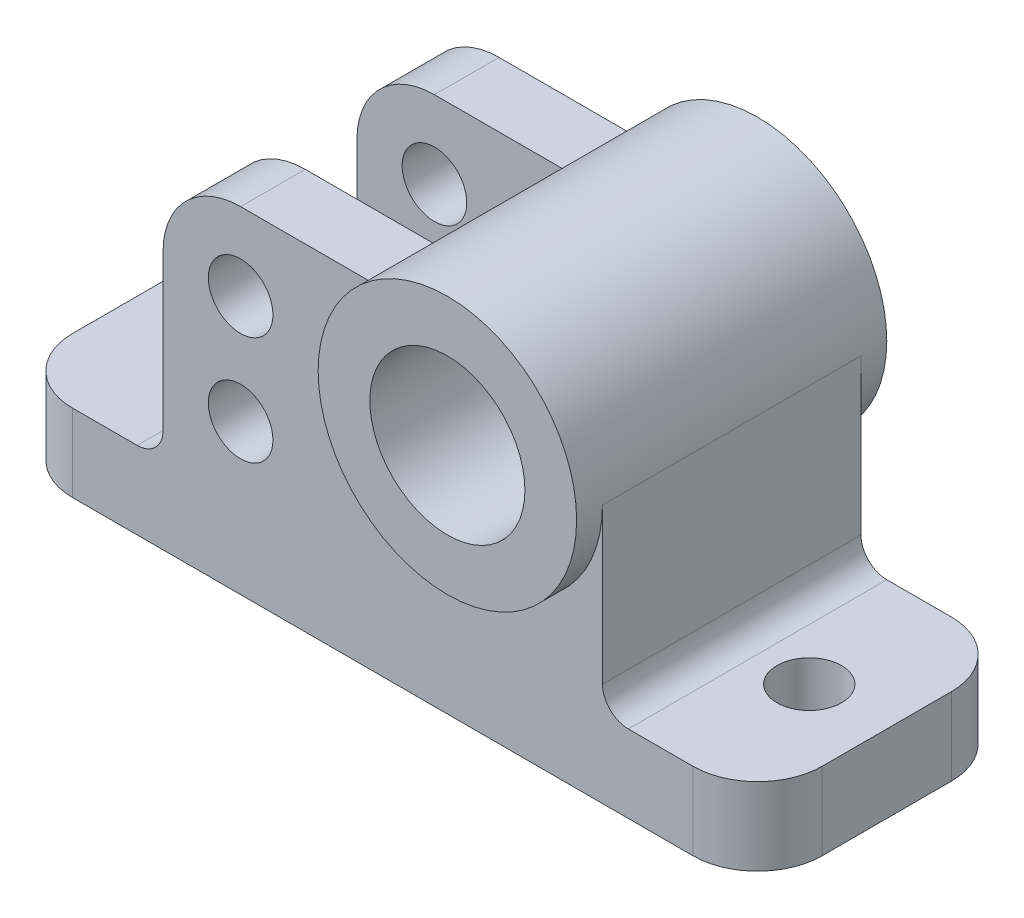
ISO-10303-21;
HEADER;
FILE_DESCRIPTION(('STEP AP214'),'2;1');
FILE_NAME('part.step','',(''),(''),'','','');
FILE_SCHEMA(('AUTOMOTIVE_DESIGN { 1 0 10303 214 1 1 1 1 }'));
ENDSEC;
DATA;
#1=APPLICATION_CONTEXT('core data for automotive mechanical design processes');
#2=APPLICATION_PROTOCOL_DEFINITION('international standard','automotive_design',2000,#1);
#3=PRODUCT_CONTEXT('',#1,'mechanical');
#4=PRODUCT('Part','Part','',(#3));
#5=PRODUCT_RELATED_PRODUCT_CATEGORY('part','',(#4));
#6=PRODUCT_DEFINITION_FORMATION('','',#4);
#7=PRODUCT_DEFINITION_CONTEXT('part definition',#1,'design');
#8=PRODUCT_DEFINITION('design','',#6,#7);
#9=PRODUCT_DEFINITION_SHAPE('','',#8);
#10=(LENGTH_UNIT() NAMED_UNIT(*) SI_UNIT(.MILLI.,.METRE.));
#11=(NAMED_UNIT(*) PLANE_ANGLE_UNIT() SI_UNIT($,.RADIAN.));
#12=(NAMED_UNIT(*) SI_UNIT($,.STERADIAN.) SOLID_ANGLE_UNIT());
#13=UNCERTAINTY_MEASURE_WITH_UNIT(LENGTH_MEASURE(1.E-05),#10,'distance_accuracy_value','');
#14=(GEOMETRIC_REPRESENTATION_CONTEXT(3) GLOBAL_UNCERTAINTY_ASSIGNED_CONTEXT((#13)) GLOBAL_UNIT_ASSIGNED_CONTEXT((#10,
#11,#12)) REPRESENTATION_CONTEXT('',''));
#15=CARTESIAN_POINT('',(0.,0.,0.));
#16=DIRECTION('',(0.,0.,1.));
#17=DIRECTION('',(1.,0.,0.));
#18=AXIS2_PLACEMENT_3D('',#15,#16,#17);
#19=CARTESIAN_POINT('',(60.,130.,50.));
#20=DIRECTION('',(0.,-1.,0.));
#21=DIRECTION('',(1.,0.,0.));
#22=AXIS2_PLACEMENT_3D('',#19,#20,#21);
#23=PLANE('',#22);
#24=DIRECTION('',(-1.,0.,0.));
#25=VECTOR('',#24,1.);
#26=CARTESIAN_POINT('',(140.,130.,-25.));
#27=LINE('',#26,#25);
#28=CARTESIAN_POINT('',(140.,130.,-25.));
#29=VERTEX_POINT('',#28);
#30=CARTESIAN_POINT('',(90.,130.,-25.));
#31=VERTEX_POINT('',#30);
#32=EDGE_CURVE('E189',#29,#31,#27,.T.);
#33=ORIENTED_EDGE('',*,*,#32,.F.);
#34=DIRECTION('',(0.,0.,-1.));
#35=VECTOR('',#34,1.);
#36=CARTESIAN_POINT('',(140.,130.,60.));
#37=LINE('',#36,#35);
#38=CARTESIAN_POINT('',(140.,130.,-50.));
#39=VERTEX_POINT('',#38);
#40=EDGE_CURVE('E201',#39,#29,#37,.F.);
#41=ORIENTED_EDGE('',*,*,#40,.F.);
#42=DIRECTION('',(-1.,0.,0.));
#43=VECTOR('',#42,1.);
#44=CARTESIAN_POINT('',(60.,130.,-50.));
#45=LINE('',#44,#43);
#46=CARTESIAN_POINT('',(90.,130.,-50.));
#47=VERTEX_POINT('',#46);
#48=EDGE_CURVE('E242',#39,#47,#45,.T.);
#49=ORIENTED_EDGE('',*,*,#48,.T.);
#50=DIRECTION('',(0.,0.,-1.));
#51=VECTOR('',#50,1.);
#52=CARTESIAN_POINT('',(90.,130.,50.));
#53=LINE('',#52,#51);
#54=EDGE_CURVE('E204',#47,#31,#53,.F.);
#55=ORIENTED_EDGE('',*,*,#54,.T.);
#56=EDGE_LOOP('',(#33,#41,#49,#55));
#57=FACE_BOUND('',#56,.T.);
#58=ADVANCED_FACE('F36',(#57),#23,.F.);
#59=CARTESIAN_POINT('',(60.,30.,50.));
#60=DIRECTION('',(1.,0.,0.));
#61=DIRECTION('',(0.,0.,-1.));
#62=AXIS2_PLACEMENT_3D('',#59,#60,#61);
#63=PLANE('',#62);
#64=DIRECTION('',(0.,-1.,0.));
#65=VECTOR('',#64,1.);
#66=CARTESIAN_POINT('',(60.,40.,-25.));
#67=LINE('',#66,#65);
#68=CARTESIAN_POINT('',(60.,100.,-25.));
#69=VERTEX_POINT('',#68);
#70=CARTESIAN_POINT('',(60.,40.,-25.));
#71=VERTEX_POINT('',#70);
#72=EDGE_CURVE('E205',#69,#71,#67,.T.);
#73=ORIENTED_EDGE('',*,*,#72,.F.);
#74=DIRECTION('',(0.,0.,-1.));
#75=VECTOR('',#74,1.);
#76=CARTESIAN_POINT('',(60.,100.,50.));
#77=LINE('',#76,#75);
#78=CARTESIAN_POINT('',(60.,100.,-50.));
#79=VERTEX_POINT('',#78);
#80=EDGE_CURVE('E268',#69,#79,#77,.T.);
#81=ORIENTED_EDGE('',*,*,#80,.T.);
#82=DIRECTION('',(0.,-1.,0.));
#83=VECTOR('',#82,1.);
#84=CARTESIAN_POINT('',(60.,30.,-50.));
#85=LINE('',#84,#83);
#86=CARTESIAN_POINT('',(60.,40.,-50.));
#87=VERTEX_POINT('',#86);
#88=EDGE_CURVE('E244',#79,#87,#85,.T.);
#89=ORIENTED_EDGE('',*,*,#88,.T.);
#90=DIRECTION('',(0.,0.,-1.));
#91=VECTOR('',#90,1.);
#92=CARTESIAN_POINT('',(60.,40.,50.));
#93=LINE('',#92,#91);
#94=EDGE_CURVE('E282',#87,#71,#93,.F.);
#95=ORIENTED_EDGE('',*,*,#94,.T.);
#96=EDGE_LOOP('',(#73,#81,#89,#95));
#97=FACE_BOUND('',#96,.T.);
#98=ADVANCED_FACE('F472',(#97),#63,.F.);
#99=CARTESIAN_POINT('',(90.,100.,50.));
#100=DIRECTION('',(0.,0.,-1.));
#101=DIRECTION('',(-1.,0.,0.));
#102=AXIS2_PLACEMENT_3D('',#99,#100,#101);
#103=CYLINDRICAL_SURFACE('',#102,30.);
#104=ORIENTED_EDGE('',*,*,#80,.F.);
#105=CARTESIAN_POINT('',(90.,100.,-25.));
#106=DIRECTION('',(0.,0.,1.));
#107=DIRECTION('',(1.,0.,0.));
#108=AXIS2_PLACEMENT_3D('',#105,#106,#107);
#109=CIRCLE('',#108,30.);
#110=EDGE_CURVE('E395',#69,#31,#109,.F.);
#111=ORIENTED_EDGE('',*,*,#110,.T.);
#112=ORIENTED_EDGE('',*,*,#54,.F.);
#113=CARTESIAN_POINT('',(90.,100.,-50.));
#114=DIRECTION('',(0.,0.,-1.));
#115=DIRECTION('',(-1.,0.,0.));
#116=AXIS2_PLACEMENT_3D('',#113,#114,#115);
#117=CIRCLE('',#116,30.);
#118=EDGE_CURVE('E260',#79,#47,#117,.T.);
#119=ORIENTED_EDGE('',*,*,#118,.F.);
#120=EDGE_LOOP('',(#104,#111,#112,#119));
#121=FACE_BOUND('',#120,.T.);
#122=ADVANCED_FACE('F480',(#121),#103,.T.);
#123=CARTESIAN_POINT('',(140.,130.,25.));
#124=VERTEX_POINT('',#123);
#125=CARTESIAN_POINT('',(140.,130.,50.));
#126=VERTEX_POINT('',#125);
#127=EDGE_CURVE('E212',#124,#126,#37,.F.);
#128=ORIENTED_EDGE('',*,*,#127,.F.);
#129=DIRECTION('',(-1.,0.,0.));
#130=VECTOR('',#129,1.);
#131=CARTESIAN_POINT('',(140.,130.,25.));
#132=LINE('',#131,#130);
#133=CARTESIAN_POINT('',(90.,130.,25.));
#134=VERTEX_POINT('',#133);
#135=EDGE_CURVE('E415',#124,#134,#132,.T.);
#136=ORIENTED_EDGE('',*,*,#135,.T.);
#137=CARTESIAN_POINT('',(90.,130.,50.));
#138=VERTEX_POINT('',#137);
#139=EDGE_CURVE('E258',#134,#138,#53,.F.);
#140=ORIENTED_EDGE('',*,*,#139,.T.);
#141=DIRECTION('',(-1.,0.,0.));
#142=VECTOR('',#141,1.);
#143=CARTESIAN_POINT('',(60.,130.,50.));
#144=LINE('',#143,#142);
#145=EDGE_CURVE('E229',#126,#138,#144,.T.);
#146=ORIENTED_EDGE('',*,*,#145,.F.);
#147=EDGE_LOOP('',(#128,#136,#140,#146));
#148=FACE_BOUND('',#147,.T.);
#149=ADVANCED_FACE('F476',(#148),#23,.F.);
#150=CARTESIAN_POINT('',(0.,0.,50.));
#151=DIRECTION('',(1.,0.,0.));
#152=DIRECTION('',(0.,0.,-1.));
#153=AXIS2_PLACEMENT_3D('',#150,#151,#152);
#154=PLANE('',#153);
#155=DIRECTION('',(0.,0.,-1.));
#156=VECTOR('',#155,1.);
#157=CARTESIAN_POINT('',(0.,30.,50.));
#158=LINE('',#157,#156);
#159=CARTESIAN_POINT('',(0.,30.,25.));
#160=VERTEX_POINT('',#159);
#161=CARTESIAN_POINT('',(0.,30.,-25.));
#162=VERTEX_POINT('',#161);
#163=EDGE_CURVE('E237',#160,#162,#158,.T.);
#164=ORIENTED_EDGE('',*,*,#163,.T.);
#165=DIRECTION('',(0.,-1.,0.));
#166=VECTOR('',#165,1.);
#167=CARTESIAN_POINT('',(0.,0.,-25.));
#168=LINE('',#167,#166);
#169=CARTESIAN_POINT('',(0.,0.,-25.));
#170=VERTEX_POINT('',#169);
#171=EDGE_CURVE('E332',#162,#170,#168,.T.);
#172=ORIENTED_EDGE('',*,*,#171,.T.);
#173=DIRECTION('',(0.,0.,-1.));
#174=VECTOR('',#173,1.);
#175=CARTESIAN_POINT('',(0.,0.,50.));
#176=LINE('',#175,#174);
#177=CARTESIAN_POINT('',(0.,0.,25.));
#178=VERTEX_POINT('',#177);
#179=EDGE_CURVE('E255',#178,#170,#176,.T.);
#180=ORIENTED_EDGE('',*,*,#179,.F.);
#181=DIRECTION('',(0.,-1.,0.));
#182=VECTOR('',#181,1.);
#183=CARTESIAN_POINT('',(0.,0.,25.));
#184=LINE('',#183,#182);
#185=EDGE_CURVE('E56',#178,#160,#184,.F.);
#186=ORIENTED_EDGE('',*,*,#185,.T.);
#187=EDGE_LOOP('',(#164,#172,#180,#186));
#188=FACE_BOUND('',#187,.T.);
#189=ADVANCED_FACE('F346',(#188),#154,.F.);
#190=CARTESIAN_POINT('',(0.,0.,50.));
#191=DIRECTION('',(0.,1.,0.));
#192=DIRECTION('',(0.,0.,1.));
#193=AXIS2_PLACEMENT_3D('',#190,#191,#192);
#194=PLANE('',#193);
#195=CARTESIAN_POINT('',(30.,0.,0.));
#196=DIRECTION('',(0.,1.,0.));
#197=DIRECTION('',(0.,0.,1.));
#198=AXIS2_PLACEMENT_3D('',#195,#196,#197);
#199=CIRCLE('',#198,12.5);
#200=CARTESIAN_POINT('',(30.,0.,12.5));
#201=VERTEX_POINT('',#200);
#202=EDGE_CURVE('E437',#201,#201,#199,.T.);
#203=ORIENTED_EDGE('',*,*,#202,.T.);
#204=EDGE_LOOP('',(#203));
#205=FACE_BOUND('',#204,.T.);
#206=CARTESIAN_POINT('',(260.,0.,0.));
#207=DIRECTION('',(0.,1.,0.));
#208=DIRECTION('',(0.,0.,1.));
#209=AXIS2_PLACEMENT_3D('',#206,#207,#208);
#210=CIRCLE('',#209,12.5);
#211=CARTESIAN_POINT('',(260.,0.,12.5));
#212=VERTEX_POINT('',#211);
#213=EDGE_CURVE('E443',#212,#212,#210,.T.);
#214=ORIENTED_EDGE('',*,*,#213,.T.);
#215=EDGE_LOOP('',(#214));
#216=FACE_BOUND('',#215,.T.);
#217=DIRECTION('',(1.,0.,0.));
#218=VECTOR('',#217,1.);
#219=CARTESIAN_POINT('',(0.,0.,-50.));
#220=LINE('',#219,#218);
#221=CARTESIAN_POINT('',(25.,0.,-50.));
#222=VERTEX_POINT('',#221);
#223=CARTESIAN_POINT('',(265.,0.,-50.));
#224=VERTEX_POINT('',#223);
#225=EDGE_CURVE('E211',#222,#224,#220,.T.);
#226=ORIENTED_EDGE('',*,*,#225,.T.);
#227=CARTESIAN_POINT('',(265.,0.,-25.));
#228=DIRECTION('',(0.,1.,0.));
#229=DIRECTION('',(0.,0.,1.));
#230=AXIS2_PLACEMENT_3D('',#227,#228,#229);
#231=CIRCLE('',#230,25.);
#232=CARTESIAN_POINT('',(290.,0.,-25.));
#233=VERTEX_POINT('',#232);
#234=EDGE_CURVE('E323',#224,#233,#231,.F.);
#235=ORIENTED_EDGE('',*,*,#234,.T.);
#236=DIRECTION('',(0.,0.,-1.));
#237=VECTOR('',#236,1.);
#238=CARTESIAN_POINT('',(290.,0.,50.));
#239=LINE('',#238,#237);
#240=CARTESIAN_POINT('',(290.,0.,25.));
#241=VERTEX_POINT('',#240);
#242=EDGE_CURVE('E252',#241,#233,#239,.T.);
#243=ORIENTED_EDGE('',*,*,#242,.F.);
#244=CARTESIAN_POINT('',(265.,0.,25.));
#245=DIRECTION('',(0.,1.,0.));
#246=DIRECTION('',(0.,0.,1.));
#247=AXIS2_PLACEMENT_3D('',#244,#245,#246);
#248=CIRCLE('',#247,25.);
#249=CARTESIAN_POINT('',(265.,0.,50.));
#250=VERTEX_POINT('',#249);
#251=EDGE_CURVE('E321',#241,#250,#248,.F.);
#252=ORIENTED_EDGE('',*,*,#251,.T.);
#253=DIRECTION('',(1.,0.,0.));
#254=VECTOR('',#253,1.);
#255=CARTESIAN_POINT('',(0.,0.,50.));
#256=LINE('',#255,#254);
#257=CARTESIAN_POINT('',(25.,0.,50.));
#258=VERTEX_POINT('',#257);
#259=EDGE_CURVE('E221',#258,#250,#256,.T.);
#260=ORIENTED_EDGE('',*,*,#259,.F.);
#261=CARTESIAN_POINT('',(25.,0.,25.));
#262=DIRECTION('',(0.,1.,0.));
#263=DIRECTION('',(0.,0.,1.));
#264=AXIS2_PLACEMENT_3D('',#261,#262,#263);
#265=CIRCLE('',#264,25.);
#266=EDGE_CURVE('E317',#258,#178,#265,.F.);
#267=ORIENTED_EDGE('',*,*,#266,.T.);
#268=ORIENTED_EDGE('',*,*,#179,.T.);
#269=CARTESIAN_POINT('',(25.,0.,-25.));
#270=DIRECTION('',(0.,1.,0.));
#271=DIRECTION('',(0.,0.,1.));
#272=AXIS2_PLACEMENT_3D('',#269,#270,#271);
#273=CIRCLE('',#272,25.);
#274=EDGE_CURVE('E319',#170,#222,#273,.F.);
#275=ORIENTED_EDGE('',*,*,#274,.T.);
#276=EDGE_LOOP('',(#226,#235,#243,#252,#260,#267,#268,#275));
#277=FACE_BOUND('',#276,.T.);
#278=ADVANCED_FACE('F345',(#205,#216,#277),#194,.F.);
#279=CARTESIAN_POINT('',(290.,0.,50.));
#280=DIRECTION('',(-1.,0.,0.));
#281=DIRECTION('',(0.,0.,1.));
#282=AXIS2_PLACEMENT_3D('',#279,#280,#281);
#283=PLANE('',#282);
#284=ORIENTED_EDGE('',*,*,#242,.T.);
#285=DIRECTION('',(0.,1.,0.));
#286=VECTOR('',#285,1.);
#287=CARTESIAN_POINT('',(290.,30.,-25.));
#288=LINE('',#287,#286);
#289=CARTESIAN_POINT('',(290.,30.,-25.));
#290=VERTEX_POINT('',#289);
#291=EDGE_CURVE('E306',#233,#290,#288,.T.);
#292=ORIENTED_EDGE('',*,*,#291,.T.);
#293=DIRECTION('',(0.,0.,-1.));
#294=VECTOR('',#293,1.);
#295=CARTESIAN_POINT('',(290.,30.,50.));
#296=LINE('',#295,#294);
#297=CARTESIAN_POINT('',(290.,30.,25.));
#298=VERTEX_POINT('',#297);
#299=EDGE_CURVE('E249',#298,#290,#296,.T.);
#300=ORIENTED_EDGE('',*,*,#299,.F.);
#301=DIRECTION('',(0.,1.,0.));
#302=VECTOR('',#301,1.);
#303=CARTESIAN_POINT('',(290.,0.,25.));
#304=LINE('',#303,#302);
#305=EDGE_CURVE('E294',#298,#241,#304,.F.);
#306=ORIENTED_EDGE('',*,*,#305,.T.);
#307=EDGE_LOOP('',(#284,#292,#300,#306));
#308=FACE_BOUND('',#307,.T.);
#309=ADVANCED_FACE('F364',(#308),#283,.F.);
#310=CARTESIAN_POINT('',(290.,30.,50.));
#311=DIRECTION('',(0.,-1.,0.));
#312=DIRECTION('',(1.,0.,0.));
#313=AXIS2_PLACEMENT_3D('',#310,#311,#312);
#314=PLANE('',#313);
#315=CARTESIAN_POINT('',(260.,30.,0.));
#316=DIRECTION('',(0.,1.,0.));
#317=DIRECTION('',(0.,0.,1.));
#318=AXIS2_PLACEMENT_3D('',#315,#316,#317);
#319=CIRCLE('',#318,12.5);
#320=CARTESIAN_POINT('',(260.,30.,12.5));
#321=VERTEX_POINT('',#320);
#322=EDGE_CURVE('E440',#321,#321,#319,.T.);
#323=ORIENTED_EDGE('',*,*,#322,.F.);
#324=EDGE_LOOP('',(#323));
#325=FACE_BOUND('',#324,.T.);
#326=ORIENTED_EDGE('',*,*,#299,.T.);
#327=CARTESIAN_POINT('',(265.,30.,-25.));
#328=DIRECTION('',(0.,-1.,0.));
#329=DIRECTION('',(1.,0.,0.));
#330=AXIS2_PLACEMENT_3D('',#327,#328,#329);
#331=CIRCLE('',#330,25.);
#332=CARTESIAN_POINT('',(265.,30.,-50.));
#333=VERTEX_POINT('',#332);
#334=EDGE_CURVE('E311',#290,#333,#331,.F.);
#335=ORIENTED_EDGE('',*,*,#334,.T.);
#336=DIRECTION('',(-1.,0.,0.));
#337=VECTOR('',#336,1.);
#338=CARTESIAN_POINT('',(290.,30.,-50.));
#339=LINE('',#338,#337);
#340=CARTESIAN_POINT('',(240.,30.,-50.));
#341=VERTEX_POINT('',#340);
#342=EDGE_CURVE('E215',#333,#341,#339,.T.);
#343=ORIENTED_EDGE('',*,*,#342,.T.);
#344=DIRECTION('',(0.,0.,-1.));
#345=VECTOR('',#344,1.);
#346=CARTESIAN_POINT('',(240.,30.,50.));
#347=LINE('',#346,#345);
#348=CARTESIAN_POINT('',(240.,30.,50.));
#349=VERTEX_POINT('',#348);
#350=EDGE_CURVE('E275',#341,#349,#347,.F.);
#351=ORIENTED_EDGE('',*,*,#350,.T.);
#352=DIRECTION('',(-1.,0.,0.));
#353=VECTOR('',#352,1.);
#354=CARTESIAN_POINT('',(290.,30.,50.));
#355=LINE('',#354,#353);
#356=CARTESIAN_POINT('',(265.,30.,50.));
#357=VERTEX_POINT('',#356);
#358=EDGE_CURVE('E224',#357,#349,#355,.T.);
#359=ORIENTED_EDGE('',*,*,#358,.F.);
#360=CARTESIAN_POINT('',(265.,30.,25.));
#361=DIRECTION('',(0.,-1.,0.));
#362=DIRECTION('',(1.,0.,0.));
#363=AXIS2_PLACEMENT_3D('',#360,#361,#362);
#364=CIRCLE('',#363,25.);
#365=EDGE_CURVE('E309',#357,#298,#364,.F.);
#366=ORIENTED_EDGE('',*,*,#365,.T.);
#367=EDGE_LOOP('',(#326,#335,#343,#351,#359,#366));
#368=FACE_BOUND('',#367,.T.);
#369=ADVANCED_FACE('F372',(#325,#368),#314,.F.);
#370=CARTESIAN_POINT('',(230.,130.,50.));
#371=DIRECTION('',(-1.,0.,0.));
#372=DIRECTION('',(0.,-1.,0.));
#373=AXIS2_PLACEMENT_3D('',#370,#371,#372);
#374=PLANE('',#373);
#375=DIRECTION('',(0.,1.,0.));
#376=VECTOR('',#375,1.);
#377=CARTESIAN_POINT('',(230.,130.,50.));
#378=LINE('',#377,#376);
#379=CARTESIAN_POINT('',(230.,40.,50.));
#380=VERTEX_POINT('',#379);
#381=CARTESIAN_POINT('',(230.,100.,50.));
#382=VERTEX_POINT('',#381);
#383=EDGE_CURVE('E227',#380,#382,#378,.T.);
#384=ORIENTED_EDGE('',*,*,#383,.F.);
#385=DIRECTION('',(0.,0.,-1.));
#386=VECTOR('',#385,1.);
#387=CARTESIAN_POINT('',(230.,40.,-50.));
#388=LINE('',#387,#386);
#389=CARTESIAN_POINT('',(230.,40.,-50.));
#390=VERTEX_POINT('',#389);
#391=EDGE_CURVE('E272',#380,#390,#388,.T.);
#392=ORIENTED_EDGE('',*,*,#391,.T.);
#393=DIRECTION('',(0.,1.,0.));
#394=VECTOR('',#393,1.);
#395=CARTESIAN_POINT('',(230.,130.,-50.));
#396=LINE('',#395,#394);
#397=CARTESIAN_POINT('',(230.,100.,-50.));
#398=VERTEX_POINT('',#397);
#399=EDGE_CURVE('E240',#390,#398,#396,.T.);
#400=ORIENTED_EDGE('',*,*,#399,.T.);
#401=DIRECTION('',(0.,0.,-1.));
#402=VECTOR('',#401,1.);
#403=CARTESIAN_POINT('',(230.,100.,50.));
#404=LINE('',#403,#402);
#405=EDGE_CURVE('E263',#398,#382,#404,.F.);
#406=ORIENTED_EDGE('',*,*,#405,.T.);
#407=EDGE_LOOP('',(#384,#392,#400,#406));
#408=FACE_BOUND('',#407,.T.);
#409=ADVANCED_FACE('F382',(#408),#374,.F.);
#410=CARTESIAN_POINT('',(60.,100.,50.));
#411=VERTEX_POINT('',#410);
#412=CARTESIAN_POINT('',(60.,100.,25.));
#413=VERTEX_POINT('',#412);
#414=EDGE_CURVE('E269',#411,#413,#77,.T.);
#415=ORIENTED_EDGE('',*,*,#414,.T.);
#416=DIRECTION('',(0.,-1.,0.));
#417=VECTOR('',#416,1.);
#418=CARTESIAN_POINT('',(60.,40.,25.));
#419=LINE('',#418,#417);
#420=CARTESIAN_POINT('',(60.,40.,25.));
#421=VERTEX_POINT('',#420);
#422=EDGE_CURVE('E412',#413,#421,#419,.T.);
#423=ORIENTED_EDGE('',*,*,#422,.T.);
#424=CARTESIAN_POINT('',(60.,40.,50.));
#425=VERTEX_POINT('',#424);
#426=EDGE_CURVE('E281',#421,#425,#93,.F.);
#427=ORIENTED_EDGE('',*,*,#426,.T.);
#428=DIRECTION('',(0.,-1.,0.));
#429=VECTOR('',#428,1.);
#430=CARTESIAN_POINT('',(60.,30.,50.));
#431=LINE('',#430,#429);
#432=EDGE_CURVE('E232',#411,#425,#431,.T.);
#433=ORIENTED_EDGE('',*,*,#432,.F.);
#434=EDGE_LOOP('',(#415,#423,#427,#433));
#435=FACE_BOUND('',#434,.T.);
#436=ADVANCED_FACE('F462',(#435),#63,.F.);
#437=CARTESIAN_POINT('',(0.,30.,50.));
#438=DIRECTION('',(0.,-1.,0.));
#439=DIRECTION('',(0.,0.,-1.));
#440=AXIS2_PLACEMENT_3D('',#437,#438,#439);
#441=PLANE('',#440);
#442=CARTESIAN_POINT('',(30.,30.,0.));
#443=DIRECTION('',(0.,1.,0.));
#444=DIRECTION('',(0.,0.,1.));
#445=AXIS2_PLACEMENT_3D('',#442,#443,#444);
#446=CIRCLE('',#445,12.5);
#447=CARTESIAN_POINT('',(30.,30.,12.5));
#448=VERTEX_POINT('',#447);
#449=EDGE_CURVE('E446',#448,#448,#446,.T.);
#450=ORIENTED_EDGE('',*,*,#449,.F.);
#451=EDGE_LOOP('',(#450));
#452=FACE_BOUND('',#451,.T.);
#453=DIRECTION('',(-1.,0.,0.));
#454=VECTOR('',#453,1.);
#455=CARTESIAN_POINT('',(0.,30.,-50.));
#456=LINE('',#455,#454);
#457=CARTESIAN_POINT('',(50.,30.,-50.));
#458=VERTEX_POINT('',#457);
#459=CARTESIAN_POINT('',(25.,30.,-50.));
#460=VERTEX_POINT('',#459);
#461=EDGE_CURVE('E225',#458,#460,#456,.T.);
#462=ORIENTED_EDGE('',*,*,#461,.T.);
#463=CARTESIAN_POINT('',(25.,30.,-25.));
#464=DIRECTION('',(0.,-1.,0.));
#465=DIRECTION('',(0.,0.,-1.));
#466=AXIS2_PLACEMENT_3D('',#463,#464,#465);
#467=CIRCLE('',#466,25.);
#468=EDGE_CURVE('E11',#460,#162,#467,.F.);
#469=ORIENTED_EDGE('',*,*,#468,.T.);
#470=ORIENTED_EDGE('',*,*,#163,.F.);
#471=CARTESIAN_POINT('',(25.,30.,25.));
#472=DIRECTION('',(0.,-1.,0.));
#473=DIRECTION('',(0.,0.,-1.));
#474=AXIS2_PLACEMENT_3D('',#471,#472,#473);
#475=CIRCLE('',#474,25.);
#476=CARTESIAN_POINT('',(25.,30.,50.));
#477=VERTEX_POINT('',#476);
#478=EDGE_CURVE('E44',#160,#477,#475,.F.);
#479=ORIENTED_EDGE('',*,*,#478,.T.);
#480=DIRECTION('',(-1.,0.,0.));
#481=VECTOR('',#480,1.);
#482=CARTESIAN_POINT('',(0.,30.,50.));
#483=LINE('',#482,#481);
#484=CARTESIAN_POINT('',(50.,30.,50.));
#485=VERTEX_POINT('',#484);
#486=EDGE_CURVE('E235',#485,#477,#483,.T.);
#487=ORIENTED_EDGE('',*,*,#486,.F.);
#488=DIRECTION('',(0.,0.,-1.));
#489=VECTOR('',#488,1.);
#490=CARTESIAN_POINT('',(50.,30.,-50.));
#491=LINE('',#490,#489);
#492=EDGE_CURVE('E278',#485,#458,#491,.T.);
#493=ORIENTED_EDGE('',*,*,#492,.T.);
#494=EDGE_LOOP('',(#462,#469,#470,#479,#487,#493));
#495=FACE_BOUND('',#494,.T.);
#496=ADVANCED_FACE('F336',(#452,#495),#441,.F.);
#497=CARTESIAN_POINT('',(0.,0.,50.));
#498=DIRECTION('',(0.,0.,-1.));
#499=DIRECTION('',(-1.,0.,0.));
#500=AXIS2_PLACEMENT_3D('',#497,#498,#499);
#501=PLANE('',#500);
#502=CARTESIAN_POINT('',(90.,100.,50.));
#503=DIRECTION('',(0.,0.,1.));
#504=DIRECTION('',(1.,0.,0.));
#505=AXIS2_PLACEMENT_3D('',#502,#503,#504);
#506=CIRCLE('',#505,12.5);
#507=CARTESIAN_POINT('',(102.5,100.,50.));
#508=VERTEX_POINT('',#507);
#509=EDGE_CURVE('E299',#508,#508,#506,.T.);
#510=ORIENTED_EDGE('',*,*,#509,.F.);
#511=EDGE_LOOP('',(#510));
#512=FACE_BOUND('',#511,.T.);
#513=CARTESIAN_POINT('',(90.,58.,50.));
#514=DIRECTION('',(0.,0.,1.));
#515=DIRECTION('',(1.,0.,0.));
#516=AXIS2_PLACEMENT_3D('',#513,#514,#515);
#517=CIRCLE('',#516,12.5);
#518=CARTESIAN_POINT('',(102.5,58.,50.));
#519=VERTEX_POINT('',#518);
#520=EDGE_CURVE('E434',#519,#519,#517,.T.);
#521=ORIENTED_EDGE('',*,*,#520,.F.);
#522=EDGE_LOOP('',(#521));
#523=FACE_BOUND('',#522,.T.);
#524=ORIENTED_EDGE('',*,*,#259,.T.);
#525=DIRECTION('',(0.,1.,0.));
#526=VECTOR('',#525,1.);
#527=CARTESIAN_POINT('',(265.,0.,50.));
#528=LINE('',#527,#526);
#529=EDGE_CURVE('E328',#250,#357,#528,.T.);
#530=ORIENTED_EDGE('',*,*,#529,.T.);
#531=ORIENTED_EDGE('',*,*,#358,.T.);
#532=CARTESIAN_POINT('',(240.,40.,50.));
#533=DIRECTION('',(0.,0.,-1.));
#534=DIRECTION('',(-1.,0.,0.));
#535=AXIS2_PLACEMENT_3D('',#532,#533,#534);
#536=CIRCLE('',#535,10.);
#537=EDGE_CURVE('E288',#349,#380,#536,.T.);
#538=ORIENTED_EDGE('',*,*,#537,.T.);
#539=ORIENTED_EDGE('',*,*,#383,.T.);
#540=CARTESIAN_POINT('',(180.,100.,50.));
#541=DIRECTION('',(0.,0.,-1.));
#542=DIRECTION('',(-1.,0.,0.));
#543=AXIS2_PLACEMENT_3D('',#540,#541,#542);
#544=CIRCLE('',#543,50.);
#545=EDGE_CURVE('E217',#126,#382,#544,.F.);
#546=ORIENTED_EDGE('',*,*,#545,.F.);
#547=ORIENTED_EDGE('',*,*,#145,.T.);
#548=CARTESIAN_POINT('',(90.,100.,50.));
#549=DIRECTION('',(0.,0.,-1.));
#550=DIRECTION('',(-1.,0.,0.));
#551=AXIS2_PLACEMENT_3D('',#548,#549,#550);
#552=CIRCLE('',#551,30.);
#553=EDGE_CURVE('E266',#138,#411,#552,.F.);
#554=ORIENTED_EDGE('',*,*,#553,.T.);
#555=ORIENTED_EDGE('',*,*,#432,.T.);
#556=CARTESIAN_POINT('',(50.,40.,50.));
#557=DIRECTION('',(0.,0.,-1.));
#558=DIRECTION('',(-1.,0.,0.));
#559=AXIS2_PLACEMENT_3D('',#556,#557,#558);
#560=CIRCLE('',#559,10.);
#561=EDGE_CURVE('E292',#425,#485,#560,.T.);
#562=ORIENTED_EDGE('',*,*,#561,.T.);
#563=ORIENTED_EDGE('',*,*,#486,.T.);
#564=DIRECTION('',(0.,-1.,0.));
#565=VECTOR('',#564,1.);
#566=CARTESIAN_POINT('',(25.,0.,50.));
#567=LINE('',#566,#565);
#568=EDGE_CURVE('E325',#477,#258,#567,.T.);
#569=ORIENTED_EDGE('',*,*,#568,.T.);
#570=EDGE_LOOP('',(#524,#530,#531,#538,#539,#546,#547,#554,#555,#562,#563,#569));
#571=FACE_BOUND('',#570,.T.);
#572=ADVANCED_FACE('F341',(#512,#523,#571),#501,.F.);
#573=CARTESIAN_POINT('',(0.,0.,-50.));
#574=DIRECTION('',(0.,0.,-1.));
#575=DIRECTION('',(-1.,0.,0.));
#576=AXIS2_PLACEMENT_3D('',#573,#574,#575);
#577=PLANE('',#576);
#578=CARTESIAN_POINT('',(90.,100.,-50.));
#579=DIRECTION('',(0.,0.,-1.));
#580=DIRECTION('',(-1.,0.,0.));
#581=AXIS2_PLACEMENT_3D('',#578,#579,#580);
#582=CIRCLE('',#581,12.5);
#583=CARTESIAN_POINT('',(77.5,100.,-50.));
#584=VERTEX_POINT('',#583);
#585=EDGE_CURVE('E421',#584,#584,#582,.T.);
#586=ORIENTED_EDGE('',*,*,#585,.F.);
#587=EDGE_LOOP('',(#586));
#588=FACE_BOUND('',#587,.T.);
#589=CARTESIAN_POINT('',(90.,58.,-50.));
#590=DIRECTION('',(0.,0.,-1.));
#591=DIRECTION('',(-1.,0.,0.));
#592=AXIS2_PLACEMENT_3D('',#589,#590,#591);
#593=CIRCLE('',#592,12.5);
#594=CARTESIAN_POINT('',(77.5,58.,-50.));
#595=VERTEX_POINT('',#594);
#596=EDGE_CURVE('E304',#595,#595,#593,.T.);
#597=ORIENTED_EDGE('',*,*,#596,.F.);
#598=EDGE_LOOP('',(#597));
#599=FACE_BOUND('',#598,.T.);
#600=ORIENTED_EDGE('',*,*,#342,.F.);
#601=DIRECTION('',(0.,1.,0.));
#602=VECTOR('',#601,1.);
#603=CARTESIAN_POINT('',(265.,0.,-50.));
#604=LINE('',#603,#602);
#605=EDGE_CURVE('E315',#333,#224,#604,.F.);
#606=ORIENTED_EDGE('',*,*,#605,.T.);
#607=ORIENTED_EDGE('',*,*,#225,.F.);
#608=DIRECTION('',(0.,-1.,0.));
#609=VECTOR('',#608,1.);
#610=CARTESIAN_POINT('',(25.,30.,-50.));
#611=LINE('',#610,#609);
#612=EDGE_CURVE('E313',#222,#460,#611,.F.);
#613=ORIENTED_EDGE('',*,*,#612,.T.);
#614=ORIENTED_EDGE('',*,*,#461,.F.);
#615=CARTESIAN_POINT('',(50.,40.,-50.));
#616=DIRECTION('',(0.,0.,-1.));
#617=DIRECTION('',(-1.,0.,0.));
#618=AXIS2_PLACEMENT_3D('',#615,#616,#617);
#619=CIRCLE('',#618,10.);
#620=EDGE_CURVE('E290',#458,#87,#619,.F.);
#621=ORIENTED_EDGE('',*,*,#620,.T.);
#622=ORIENTED_EDGE('',*,*,#88,.F.);
#623=ORIENTED_EDGE('',*,*,#118,.T.);
#624=ORIENTED_EDGE('',*,*,#48,.F.);
#625=CARTESIAN_POINT('',(180.,100.,-50.));
#626=DIRECTION('',(0.,0.,-1.));
#627=DIRECTION('',(-1.,0.,0.));
#628=AXIS2_PLACEMENT_3D('',#625,#626,#627);
#629=CIRCLE('',#628,50.);
#630=EDGE_CURVE('E210',#39,#398,#629,.F.);
#631=ORIENTED_EDGE('',*,*,#630,.T.);
#632=ORIENTED_EDGE('',*,*,#399,.F.);
#633=CARTESIAN_POINT('',(240.,40.,-50.));
#634=DIRECTION('',(0.,0.,-1.));
#635=DIRECTION('',(-1.,0.,0.));
#636=AXIS2_PLACEMENT_3D('',#633,#634,#635);
#637=CIRCLE('',#636,10.);
#638=EDGE_CURVE('E285',#390,#341,#637,.F.);
#639=ORIENTED_EDGE('',*,*,#638,.T.);
#640=EDGE_LOOP('',(#600,#606,#607,#613,#614,#621,#622,#623,#624,#631,#632,#639));
#641=FACE_BOUND('',#640,.T.);
#642=ADVANCED_FACE('F355',(#588,#599,#641),#577,.T.);
#643=CARTESIAN_POINT('',(90.,100.,25.));
#644=DIRECTION('',(0.,0.,1.));
#645=DIRECTION('',(1.,0.,0.));
#646=AXIS2_PLACEMENT_3D('',#643,#644,#645);
#647=CIRCLE('',#646,30.);
#648=EDGE_CURVE('E399',#413,#134,#647,.F.);
#649=ORIENTED_EDGE('',*,*,#648,.F.);
#650=ORIENTED_EDGE('',*,*,#414,.F.);
#651=ORIENTED_EDGE('',*,*,#553,.F.);
#652=ORIENTED_EDGE('',*,*,#139,.F.);
#653=EDGE_LOOP('',(#649,#650,#651,#652));
#654=FACE_BOUND('',#653,.T.);
#655=ADVANCED_FACE('F492',(#654),#103,.T.);
#656=CARTESIAN_POINT('',(180.,100.,60.));
#657=DIRECTION('',(0.,0.,-1.));
#658=DIRECTION('',(-1.,0.,0.));
#659=AXIS2_PLACEMENT_3D('',#656,#657,#658);
#660=CYLINDRICAL_SURFACE('',#659,50.);
#661=CARTESIAN_POINT('',(180.,100.,60.));
#662=DIRECTION('',(0.,0.,1.));
#663=DIRECTION('',(1.,0.,0.));
#664=AXIS2_PLACEMENT_3D('',#661,#662,#663);
#665=CIRCLE('',#664,50.);
#666=CARTESIAN_POINT('',(230.,100.,60.));
#667=VERTEX_POINT('',#666);
#668=EDGE_CURVE('E384',#667,#667,#665,.T.);
#669=ORIENTED_EDGE('',*,*,#668,.F.);
#670=EDGE_LOOP('',(#669));
#671=FACE_BOUND('',#670,.T.);
#672=CARTESIAN_POINT('',(180.,100.,-60.));
#673=DIRECTION('',(0.,0.,1.));
#674=DIRECTION('',(1.,0.,0.));
#675=AXIS2_PLACEMENT_3D('',#672,#673,#674);
#676=CIRCLE('',#675,50.);
#677=CARTESIAN_POINT('',(230.,100.,-60.));
#678=VERTEX_POINT('',#677);
#679=EDGE_CURVE('E386',#678,#678,#676,.T.);
#680=ORIENTED_EDGE('',*,*,#679,.T.);
#681=EDGE_LOOP('',(#680));
#682=FACE_BOUND('',#681,.T.);
#683=ORIENTED_EDGE('',*,*,#630,.F.);
#684=ORIENTED_EDGE('',*,*,#40,.T.);
#685=CARTESIAN_POINT('',(180.,100.,-25.));
#686=DIRECTION('',(0.,0.,-1.));
#687=DIRECTION('',(1.,0.,0.));
#688=AXIS2_PLACEMENT_3D('',#685,#686,#687);
#689=CIRCLE('',#688,50.);
#690=CARTESIAN_POINT('',(130.,100.,-25.));
#691=VERTEX_POINT('',#690);
#692=EDGE_CURVE('E185',#691,#29,#689,.T.);
#693=ORIENTED_EDGE('',*,*,#692,.F.);
#694=DIRECTION('',(0.,0.,1.));
#695=VECTOR('',#694,1.);
#696=CARTESIAN_POINT('',(130.,100.,-25.));
#697=LINE('',#696,#695);
#698=CARTESIAN_POINT('',(130.,100.,25.));
#699=VERTEX_POINT('',#698);
#700=EDGE_CURVE('E401',#691,#699,#697,.T.);
#701=ORIENTED_EDGE('',*,*,#700,.T.);
#702=CARTESIAN_POINT('',(180.,100.,25.));
#703=DIRECTION('',(0.,0.,-1.));
#704=DIRECTION('',(1.,0.,0.));
#705=AXIS2_PLACEMENT_3D('',#702,#703,#704);
#706=CIRCLE('',#705,50.);
#707=EDGE_CURVE('E418',#699,#124,#706,.T.);
#708=ORIENTED_EDGE('',*,*,#707,.T.);
#709=ORIENTED_EDGE('',*,*,#127,.T.);
#710=ORIENTED_EDGE('',*,*,#545,.T.);
#711=ORIENTED_EDGE('',*,*,#405,.F.);
#712=EDGE_LOOP('',(#683,#684,#693,#701,#708,#709,#710,#711));
#713=FACE_BOUND('',#712,.T.);
#714=ADVANCED_FACE('F207',(#671,#682,#713),#660,.T.);
#715=CARTESIAN_POINT('',(180.,100.,60.));
#716=DIRECTION('',(0.,0.,1.));
#717=DIRECTION('',(1.,0.,0.));
#718=AXIS2_PLACEMENT_3D('',#715,#716,#717);
#719=PLANE('',#718);
#720=CARTESIAN_POINT('',(180.,100.,60.));
#721=DIRECTION('',(0.,0.,1.));
#722=DIRECTION('',(1.,0.,0.));
#723=AXIS2_PLACEMENT_3D('',#720,#721,#722);
#724=CIRCLE('',#723,30.);
#725=CARTESIAN_POINT('',(210.,100.,60.));
#726=VERTEX_POINT('',#725);
#727=EDGE_CURVE('E392',#726,#726,#724,.T.);
#728=ORIENTED_EDGE('',*,*,#727,.F.);
#729=EDGE_LOOP('',(#728));
#730=FACE_BOUND('',#729,.T.);
#731=ORIENTED_EDGE('',*,*,#668,.T.);
#732=EDGE_LOOP('',(#731));
#733=FACE_BOUND('',#732,.T.);
#734=ADVANCED_FACE('F535',(#730,#733),#719,.T.);
#735=CARTESIAN_POINT('',(180.,100.,-60.));
#736=DIRECTION('',(0.,0.,1.));
#737=DIRECTION('',(1.,0.,0.));
#738=AXIS2_PLACEMENT_3D('',#735,#736,#737);
#739=PLANE('',#738);
#740=CARTESIAN_POINT('',(180.,100.,-60.));
#741=DIRECTION('',(0.,0.,1.));
#742=DIRECTION('',(1.,0.,0.));
#743=AXIS2_PLACEMENT_3D('',#740,#741,#742);
#744=CIRCLE('',#743,30.);
#745=CARTESIAN_POINT('',(210.,100.,-60.));
#746=VERTEX_POINT('',#745);
#747=EDGE_CURVE('E390',#746,#746,#744,.T.);
#748=ORIENTED_EDGE('',*,*,#747,.T.);
#749=EDGE_LOOP('',(#748));
#750=FACE_BOUND('',#749,.T.);
#751=ORIENTED_EDGE('',*,*,#679,.F.);
#752=EDGE_LOOP('',(#751));
#753=FACE_BOUND('',#752,.T.);
#754=ADVANCED_FACE('F533',(#750,#753),#739,.F.);
#755=CARTESIAN_POINT('',(180.,100.,-60.));
#756=DIRECTION('',(0.,0.,1.));
#757=DIRECTION('',(1.,0.,0.));
#758=AXIS2_PLACEMENT_3D('',#755,#756,#757);
#759=CYLINDRICAL_SURFACE('',#758,30.);
#760=ORIENTED_EDGE('',*,*,#747,.F.);
#761=EDGE_LOOP('',(#760));
#762=FACE_BOUND('',#761,.T.);
#763=ORIENTED_EDGE('',*,*,#727,.T.);
#764=EDGE_LOOP('',(#763));
#765=FACE_BOUND('',#764,.T.);
#766=ADVANCED_FACE('F530',(#762,#765),#759,.F.);
#767=CARTESIAN_POINT('',(240.,40.,50.));
#768=DIRECTION('',(0.,0.,1.));
#769=DIRECTION('',(1.,0.,0.));
#770=AXIS2_PLACEMENT_3D('',#767,#768,#769);
#771=CYLINDRICAL_SURFACE('',#770,10.);
#772=ORIENTED_EDGE('',*,*,#537,.F.);
#773=ORIENTED_EDGE('',*,*,#350,.F.);
#774=ORIENTED_EDGE('',*,*,#638,.F.);
#775=ORIENTED_EDGE('',*,*,#391,.F.);
#776=EDGE_LOOP('',(#772,#773,#774,#775));
#777=FACE_BOUND('',#776,.T.);
#778=ADVANCED_FACE('F377',(#777),#771,.F.);
#779=CARTESIAN_POINT('',(50.,40.,50.));
#780=DIRECTION('',(0.,0.,1.));
#781=DIRECTION('',(1.,0.,0.));
#782=AXIS2_PLACEMENT_3D('',#779,#780,#781);
#783=CYLINDRICAL_SURFACE('',#782,10.);
#784=ORIENTED_EDGE('',*,*,#561,.F.);
#785=ORIENTED_EDGE('',*,*,#426,.F.);
#786=DIRECTION('',(0.,0.,1.));
#787=VECTOR('',#786,1.);
#788=CARTESIAN_POINT('',(60.,40.,-25.));
#789=LINE('',#788,#787);
#790=EDGE_CURVE('E402',#71,#421,#789,.T.);
#791=ORIENTED_EDGE('',*,*,#790,.F.);
#792=ORIENTED_EDGE('',*,*,#94,.F.);
#793=ORIENTED_EDGE('',*,*,#620,.F.);
#794=ORIENTED_EDGE('',*,*,#492,.F.);
#795=EDGE_LOOP('',(#784,#785,#791,#792,#793,#794));
#796=FACE_BOUND('',#795,.T.);
#797=ADVANCED_FACE('F504',(#796),#783,.F.);
#798=CARTESIAN_POINT('',(130.,100.,-25.));
#799=DIRECTION('',(1.,0.,0.));
#800=DIRECTION('',(0.,0.,-1.));
#801=AXIS2_PLACEMENT_3D('',#798,#799,#800);
#802=PLANE('',#801);
#803=DIRECTION('',(0.,1.,0.));
#804=VECTOR('',#803,1.);
#805=CARTESIAN_POINT('',(130.,100.,25.));
#806=LINE('',#805,#804);
#807=CARTESIAN_POINT('',(130.,40.,25.));
#808=VERTEX_POINT('',#807);
#809=EDGE_CURVE('E196',#808,#699,#806,.T.);
#810=ORIENTED_EDGE('',*,*,#809,.T.);
#811=ORIENTED_EDGE('',*,*,#700,.F.);
#812=DIRECTION('',(0.,1.,0.));
#813=VECTOR('',#812,1.);
#814=CARTESIAN_POINT('',(130.,100.,-25.));
#815=LINE('',#814,#813);
#816=CARTESIAN_POINT('',(130.,40.,-25.));
#817=VERTEX_POINT('',#816);
#818=EDGE_CURVE('E193',#817,#691,#815,.T.);
#819=ORIENTED_EDGE('',*,*,#818,.F.);
#820=DIRECTION('',(0.,0.,1.));
#821=VECTOR('',#820,1.);
#822=CARTESIAN_POINT('',(130.,40.,-25.));
#823=LINE('',#822,#821);
#824=EDGE_CURVE('E404',#817,#808,#823,.T.);
#825=ORIENTED_EDGE('',*,*,#824,.T.);
#826=EDGE_LOOP('',(#810,#811,#819,#825));
#827=FACE_BOUND('',#826,.T.);
#828=ADVANCED_FACE('F518',(#827),#802,.F.);
#829=CARTESIAN_POINT('',(130.,40.,-25.));
#830=DIRECTION('',(0.,-1.,0.));
#831=DIRECTION('',(1.,0.,0.));
#832=AXIS2_PLACEMENT_3D('',#829,#830,#831);
#833=PLANE('',#832);
#834=DIRECTION('',(1.,0.,0.));
#835=VECTOR('',#834,1.);
#836=CARTESIAN_POINT('',(130.,40.,25.));
#837=LINE('',#836,#835);
#838=EDGE_CURVE('E409',#421,#808,#837,.T.);
#839=ORIENTED_EDGE('',*,*,#838,.T.);
#840=ORIENTED_EDGE('',*,*,#824,.F.);
#841=DIRECTION('',(1.,0.,0.));
#842=VECTOR('',#841,1.);
#843=CARTESIAN_POINT('',(130.,40.,-25.));
#844=LINE('',#843,#842);
#845=EDGE_CURVE('E423',#71,#817,#844,.T.);
#846=ORIENTED_EDGE('',*,*,#845,.F.);
#847=ORIENTED_EDGE('',*,*,#790,.T.);
#848=EDGE_LOOP('',(#839,#840,#846,#847));
#849=FACE_BOUND('',#848,.T.);
#850=ADVANCED_FACE('F513',(#849),#833,.F.);
#851=CARTESIAN_POINT('',(180.,100.,-25.));
#852=DIRECTION('',(0.,0.,1.));
#853=DIRECTION('',(1.,0.,0.));
#854=AXIS2_PLACEMENT_3D('',#851,#852,#853);
#855=PLANE('',#854);
#856=CARTESIAN_POINT('',(90.,100.,-25.));
#857=DIRECTION('',(0.,0.,1.));
#858=DIRECTION('',(1.,0.,0.));
#859=AXIS2_PLACEMENT_3D('',#856,#857,#858);
#860=CIRCLE('',#859,12.5);
#861=CARTESIAN_POINT('',(102.5,100.,-25.));
#862=VERTEX_POINT('',#861);
#863=EDGE_CURVE('E303',#862,#862,#860,.T.);
#864=ORIENTED_EDGE('',*,*,#863,.F.);
#865=EDGE_LOOP('',(#864));
#866=FACE_BOUND('',#865,.T.);
#867=CARTESIAN_POINT('',(90.,58.,-25.));
#868=DIRECTION('',(0.,0.,1.));
#869=DIRECTION('',(1.,0.,0.));
#870=AXIS2_PLACEMENT_3D('',#867,#868,#869);
#871=CIRCLE('',#870,12.5);
#872=CARTESIAN_POINT('',(102.5,58.,-25.));
#873=VERTEX_POINT('',#872);
#874=EDGE_CURVE('E298',#873,#873,#871,.T.);
#875=ORIENTED_EDGE('',*,*,#874,.F.);
#876=EDGE_LOOP('',(#875));
#877=FACE_BOUND('',#876,.T.);
#878=ORIENTED_EDGE('',*,*,#72,.T.);
#879=ORIENTED_EDGE('',*,*,#845,.T.);
#880=ORIENTED_EDGE('',*,*,#818,.T.);
#881=ORIENTED_EDGE('',*,*,#692,.T.);
#882=ORIENTED_EDGE('',*,*,#32,.T.);
#883=ORIENTED_EDGE('',*,*,#110,.F.);
#884=EDGE_LOOP('',(#878,#879,#880,#881,#882,#883));
#885=FACE_BOUND('',#884,.T.);
#886=ADVANCED_FACE('F188',(#866,#877,#885),#855,.T.);
#887=CARTESIAN_POINT('',(180.,100.,25.));
#888=DIRECTION('',(0.,0.,1.));
#889=DIRECTION('',(1.,0.,0.));
#890=AXIS2_PLACEMENT_3D('',#887,#888,#889);
#891=PLANE('',#890);
#892=CARTESIAN_POINT('',(90.,100.,25.));
#893=DIRECTION('',(0.,0.,1.));
#894=DIRECTION('',(1.,0.,0.));
#895=AXIS2_PLACEMENT_3D('',#892,#893,#894);
#896=CIRCLE('',#895,12.5);
#897=CARTESIAN_POINT('',(102.5,100.,25.));
#898=VERTEX_POINT('',#897);
#899=EDGE_CURVE('E300',#898,#898,#896,.T.);
#900=ORIENTED_EDGE('',*,*,#899,.T.);
#901=EDGE_LOOP('',(#900));
#902=FACE_BOUND('',#901,.T.);
#903=CARTESIAN_POINT('',(90.,58.,25.));
#904=DIRECTION('',(0.,0.,1.));
#905=DIRECTION('',(1.,0.,0.));
#906=AXIS2_PLACEMENT_3D('',#903,#904,#905);
#907=CIRCLE('',#906,12.5);
#908=CARTESIAN_POINT('',(102.5,58.,25.));
#909=VERTEX_POINT('',#908);
#910=EDGE_CURVE('E295',#909,#909,#907,.T.);
#911=ORIENTED_EDGE('',*,*,#910,.T.);
#912=EDGE_LOOP('',(#911));
#913=FACE_BOUND('',#912,.T.);
#914=ORIENTED_EDGE('',*,*,#648,.T.);
#915=ORIENTED_EDGE('',*,*,#135,.F.);
#916=ORIENTED_EDGE('',*,*,#707,.F.);
#917=ORIENTED_EDGE('',*,*,#809,.F.);
#918=ORIENTED_EDGE('',*,*,#838,.F.);
#919=ORIENTED_EDGE('',*,*,#422,.F.);
#920=EDGE_LOOP('',(#914,#915,#916,#917,#918,#919));
#921=FACE_BOUND('',#920,.T.);
#922=ADVANCED_FACE('F516',(#902,#913,#921),#891,.F.);
#923=CARTESIAN_POINT('',(90.,58.,-60.));
#924=DIRECTION('',(0.,0.,1.));
#925=DIRECTION('',(1.,0.,0.));
#926=AXIS2_PLACEMENT_3D('',#923,#924,#925);
#927=CYLINDRICAL_SURFACE('',#926,12.5);
#928=ORIENTED_EDGE('',*,*,#520,.T.);
#929=EDGE_LOOP('',(#928));
#930=FACE_BOUND('',#929,.T.);
#931=ORIENTED_EDGE('',*,*,#910,.F.);
#932=EDGE_LOOP('',(#931));
#933=FACE_BOUND('',#932,.T.);
#934=ADVANCED_FACE('F559',(#930,#933),#927,.F.);
#935=CARTESIAN_POINT('',(90.,100.,-60.));
#936=DIRECTION('',(0.,0.,1.));
#937=DIRECTION('',(1.,0.,0.));
#938=AXIS2_PLACEMENT_3D('',#935,#936,#937);
#939=CYLINDRICAL_SURFACE('',#938,12.5);
#940=ORIENTED_EDGE('',*,*,#509,.T.);
#941=EDGE_LOOP('',(#940));
#942=FACE_BOUND('',#941,.T.);
#943=ORIENTED_EDGE('',*,*,#899,.F.);
#944=EDGE_LOOP('',(#943));
#945=FACE_BOUND('',#944,.T.);
#946=ADVANCED_FACE('F557',(#942,#945),#939,.F.);
#947=ORIENTED_EDGE('',*,*,#596,.T.);
#948=EDGE_LOOP('',(#947));
#949=FACE_BOUND('',#948,.T.);
#950=ORIENTED_EDGE('',*,*,#874,.T.);
#951=EDGE_LOOP('',(#950));
#952=FACE_BOUND('',#951,.T.);
#953=ADVANCED_FACE('F553',(#949,#952),#927,.F.);
#954=ORIENTED_EDGE('',*,*,#585,.T.);
#955=EDGE_LOOP('',(#954));
#956=FACE_BOUND('',#955,.T.);
#957=ORIENTED_EDGE('',*,*,#863,.T.);
#958=EDGE_LOOP('',(#957));
#959=FACE_BOUND('',#958,.T.);
#960=ADVANCED_FACE('F556',(#956,#959),#939,.F.);
#961=CARTESIAN_POINT('',(265.,0.,-25.));
#962=DIRECTION('',(0.,-1.,0.));
#963=DIRECTION('',(0.,0.,-1.));
#964=AXIS2_PLACEMENT_3D('',#961,#962,#963);
#965=CYLINDRICAL_SURFACE('',#964,25.);
#966=ORIENTED_EDGE('',*,*,#234,.F.);
#967=ORIENTED_EDGE('',*,*,#605,.F.);
#968=ORIENTED_EDGE('',*,*,#334,.F.);
#969=ORIENTED_EDGE('',*,*,#291,.F.);
#970=EDGE_LOOP('',(#966,#967,#968,#969));
#971=FACE_BOUND('',#970,.T.);
#972=ADVANCED_FACE('F359',(#971),#965,.T.);
#973=CARTESIAN_POINT('',(265.,0.,25.));
#974=DIRECTION('',(0.,1.,0.));
#975=DIRECTION('',(0.,0.,1.));
#976=AXIS2_PLACEMENT_3D('',#973,#974,#975);
#977=CYLINDRICAL_SURFACE('',#976,25.);
#978=ORIENTED_EDGE('',*,*,#251,.F.);
#979=ORIENTED_EDGE('',*,*,#305,.F.);
#980=ORIENTED_EDGE('',*,*,#365,.F.);
#981=ORIENTED_EDGE('',*,*,#529,.F.);
#982=EDGE_LOOP('',(#978,#979,#980,#981));
#983=FACE_BOUND('',#982,.T.);
#984=ADVANCED_FACE('F368',(#983),#977,.T.);
#985=CARTESIAN_POINT('',(25.,0.,-25.));
#986=DIRECTION('',(0.,1.,0.));
#987=DIRECTION('',(0.,0.,1.));
#988=AXIS2_PLACEMENT_3D('',#985,#986,#987);
#989=CYLINDRICAL_SURFACE('',#988,25.);
#990=ORIENTED_EDGE('',*,*,#468,.F.);
#991=ORIENTED_EDGE('',*,*,#612,.F.);
#992=ORIENTED_EDGE('',*,*,#274,.F.);
#993=ORIENTED_EDGE('',*,*,#171,.F.);
#994=EDGE_LOOP('',(#990,#991,#992,#993));
#995=FACE_BOUND('',#994,.T.);
#996=ADVANCED_FACE('F349',(#995),#989,.T.);
#997=CARTESIAN_POINT('',(25.,0.,25.));
#998=DIRECTION('',(0.,-1.,0.));
#999=DIRECTION('',(0.,0.,-1.));
#1000=AXIS2_PLACEMENT_3D('',#997,#998,#999);
#1001=CYLINDRICAL_SURFACE('',#1000,25.);
#1002=ORIENTED_EDGE('',*,*,#478,.F.);
#1003=ORIENTED_EDGE('',*,*,#185,.F.);
#1004=ORIENTED_EDGE('',*,*,#266,.F.);
#1005=ORIENTED_EDGE('',*,*,#568,.F.);
#1006=EDGE_LOOP('',(#1002,#1003,#1004,#1005));
#1007=FACE_BOUND('',#1006,.T.);
#1008=ADVANCED_FACE('F38',(#1007),#1001,.T.);
#1009=CARTESIAN_POINT('',(30.,0.,0.));
#1010=DIRECTION('',(0.,1.,0.));
#1011=DIRECTION('',(0.,0.,1.));
#1012=AXIS2_PLACEMENT_3D('',#1009,#1010,#1011);
#1013=CYLINDRICAL_SURFACE('',#1012,12.5);
#1014=ORIENTED_EDGE('',*,*,#202,.F.);
#1015=EDGE_LOOP('',(#1014));
#1016=FACE_BOUND('',#1015,.T.);
#1017=ORIENTED_EDGE('',*,*,#449,.T.);
#1018=EDGE_LOOP('',(#1017));
#1019=FACE_BOUND('',#1018,.T.);
#1020=ADVANCED_FACE('F454',(#1016,#1019),#1013,.F.);
#1021=CARTESIAN_POINT('',(260.,0.,0.));
#1022=DIRECTION('',(0.,1.,0.));
#1023=DIRECTION('',(0.,0.,1.));
#1024=AXIS2_PLACEMENT_3D('',#1021,#1022,#1023);
#1025=CYLINDRICAL_SURFACE('',#1024,12.5);
#1026=ORIENTED_EDGE('',*,*,#213,.F.);
#1027=EDGE_LOOP('',(#1026));
#1028=FACE_BOUND('',#1027,.T.);
#1029=ORIENTED_EDGE('',*,*,#322,.T.);
#1030=EDGE_LOOP('',(#1029));
#1031=FACE_BOUND('',#1030,.T.);
#1032=ADVANCED_FACE('F457',(#1028,#1031),#1025,.F.);
#1033=CLOSED_SHELL('',(#58,#98,#122,#149,#189,#278,#309,#369,#409,#436,#496,#572,#642,#655,#714,
#734,#754,#766,#778,#797,#828,#850,#886,#922,#934,#946,#953,#960,#972,#984,#996,#1008,#1020,#1032));
#1034=MANIFOLD_SOLID_BREP('B2',#1033);
#1035=ADVANCED_BREP_SHAPE_REPRESENTATION('',(#18,#1034),#14);
#1036=SHAPE_DEFINITION_REPRESENTATION(#9,#1035);
ENDSEC;
END-ISO-10303-21;
